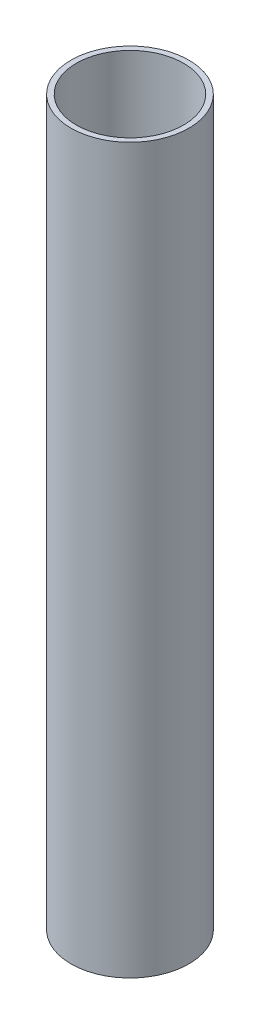
ISO-10303-21;
HEADER;
FILE_DESCRIPTION(('STEP AP214'),'2;1');
FILE_NAME('part.step','',(''),(''),'','','');
FILE_SCHEMA(('AUTOMOTIVE_DESIGN { 1 0 10303 214 1 1 1 1 }'));
ENDSEC;
DATA;
#1=APPLICATION_CONTEXT('core data for automotive mechanical design processes');
#2=APPLICATION_PROTOCOL_DEFINITION('international standard','automotive_design',2000,#1);
#3=PRODUCT_CONTEXT('',#1,'mechanical');
#4=PRODUCT('Part','Part','',(#3));
#5=PRODUCT_RELATED_PRODUCT_CATEGORY('part','',(#4));
#6=PRODUCT_DEFINITION_FORMATION('','',#4);
#7=PRODUCT_DEFINITION_CONTEXT('part definition',#1,'design');
#8=PRODUCT_DEFINITION('design','',#6,#7);
#9=PRODUCT_DEFINITION_SHAPE('','',#8);
#10=(LENGTH_UNIT() NAMED_UNIT(*) SI_UNIT(.MILLI.,.METRE.));
#11=(NAMED_UNIT(*) PLANE_ANGLE_UNIT() SI_UNIT($,.RADIAN.));
#12=(NAMED_UNIT(*) SI_UNIT($,.STERADIAN.) SOLID_ANGLE_UNIT());
#13=UNCERTAINTY_MEASURE_WITH_UNIT(LENGTH_MEASURE(1.E-05),#10,'distance_accuracy_value','');
#14=(GEOMETRIC_REPRESENTATION_CONTEXT(3) GLOBAL_UNCERTAINTY_ASSIGNED_CONTEXT((#13)) GLOBAL_UNIT_ASSIGNED_CONTEXT((#10,
#11,#12)) REPRESENTATION_CONTEXT('',''));
#15=CARTESIAN_POINT('',(0.,0.,0.));
#16=DIRECTION('',(0.,0.,1.));
#17=DIRECTION('',(1.,0.,0.));
#18=AXIS2_PLACEMENT_3D('',#15,#16,#17);
#19=CARTESIAN_POINT('',(0.,135.,0.));
#20=DIRECTION('',(0.,1.,0.));
#21=DIRECTION('',(0.,0.,1.));
#22=AXIS2_PLACEMENT_3D('',#19,#20,#21);
#23=PLANE('',#22);
#24=CARTESIAN_POINT('',(0.,135.,0.));
#25=DIRECTION('',(0.,1.,0.));
#26=DIRECTION('',(0.,0.,1.));
#27=AXIS2_PLACEMENT_3D('',#24,#25,#26);
#28=CIRCLE('',#27,11.);
#29=CARTESIAN_POINT('',(0.,135.,11.));
#30=VERTEX_POINT('',#29);
#31=EDGE_CURVE('E11',#30,#30,#28,.T.);
#32=ORIENTED_EDGE('',*,*,#31,.T.);
#33=EDGE_LOOP('',(#32));
#34=FACE_BOUND('',#33,.T.);
#35=CARTESIAN_POINT('',(0.,135.,0.));
#36=DIRECTION('',(0.,1.,0.));
#37=DIRECTION('',(0.,0.,1.));
#38=AXIS2_PLACEMENT_3D('',#35,#36,#37);
#39=CIRCLE('',#38,10.);
#40=CARTESIAN_POINT('',(0.,135.,10.));
#41=VERTEX_POINT('',#40);
#42=EDGE_CURVE('E49',#41,#41,#39,.T.);
#43=ORIENTED_EDGE('',*,*,#42,.F.);
#44=EDGE_LOOP('',(#43));
#45=FACE_BOUND('',#44,.T.);
#46=ADVANCED_FACE('F38',(#34,#45),#23,.T.);
#47=CARTESIAN_POINT('',(0.,0.,0.));
#48=DIRECTION('',(0.,1.,0.));
#49=DIRECTION('',(0.,0.,1.));
#50=AXIS2_PLACEMENT_3D('',#47,#48,#49);
#51=PLANE('',#50);
#52=CARTESIAN_POINT('',(0.,0.,0.));
#53=DIRECTION('',(0.,1.,0.));
#54=DIRECTION('',(0.,0.,1.));
#55=AXIS2_PLACEMENT_3D('',#52,#53,#54);
#56=CIRCLE('',#55,11.);
#57=CARTESIAN_POINT('',(0.,0.,11.));
#58=VERTEX_POINT('',#57);
#59=EDGE_CURVE('E42',#58,#58,#56,.T.);
#60=ORIENTED_EDGE('',*,*,#59,.F.);
#61=EDGE_LOOP('',(#60));
#62=FACE_BOUND('',#61,.T.);
#63=CARTESIAN_POINT('',(0.,0.,0.));
#64=DIRECTION('',(0.,1.,0.));
#65=DIRECTION('',(0.,0.,1.));
#66=AXIS2_PLACEMENT_3D('',#63,#64,#65);
#67=CIRCLE('',#66,10.);
#68=CARTESIAN_POINT('',(0.,0.,10.));
#69=VERTEX_POINT('',#68);
#70=EDGE_CURVE('E51',#69,#69,#67,.T.);
#71=ORIENTED_EDGE('',*,*,#70,.T.);
#72=EDGE_LOOP('',(#71));
#73=FACE_BOUND('',#72,.T.);
#74=ADVANCED_FACE('F61',(#62,#73),#51,.F.);
#75=CARTESIAN_POINT('',(0.,135.,0.));
#76=DIRECTION('',(0.,-1.,0.));
#77=DIRECTION('',(0.,0.,-1.));
#78=AXIS2_PLACEMENT_3D('',#75,#76,#77);
#79=CYLINDRICAL_SURFACE('',#78,11.);
#80=ORIENTED_EDGE('',*,*,#31,.F.);
#81=EDGE_LOOP('',(#80));
#82=FACE_BOUND('',#81,.T.);
#83=ORIENTED_EDGE('',*,*,#59,.T.);
#84=EDGE_LOOP('',(#83));
#85=FACE_BOUND('',#84,.T.);
#86=ADVANCED_FACE('F40',(#82,#85),#79,.T.);
#87=CARTESIAN_POINT('',(0.,135.,0.));
#88=DIRECTION('',(0.,-1.,0.));
#89=DIRECTION('',(0.,0.,-1.));
#90=AXIS2_PLACEMENT_3D('',#87,#88,#89);
#91=CYLINDRICAL_SURFACE('',#90,10.);
#92=ORIENTED_EDGE('',*,*,#42,.T.);
#93=EDGE_LOOP('',(#92));
#94=FACE_BOUND('',#93,.T.);
#95=ORIENTED_EDGE('',*,*,#70,.F.);
#96=EDGE_LOOP('',(#95));
#97=FACE_BOUND('',#96,.T.);
#98=ADVANCED_FACE('F57',(#94,#97),#91,.F.);
#99=CLOSED_SHELL('',(#46,#74,#86,#98));
#100=MANIFOLD_SOLID_BREP('B2',#99);
#101=ADVANCED_BREP_SHAPE_REPRESENTATION('',(#18,#100),#14);
#102=SHAPE_DEFINITION_REPRESENTATION(#9,#101);
ENDSEC;
END-ISO-10303-21;
